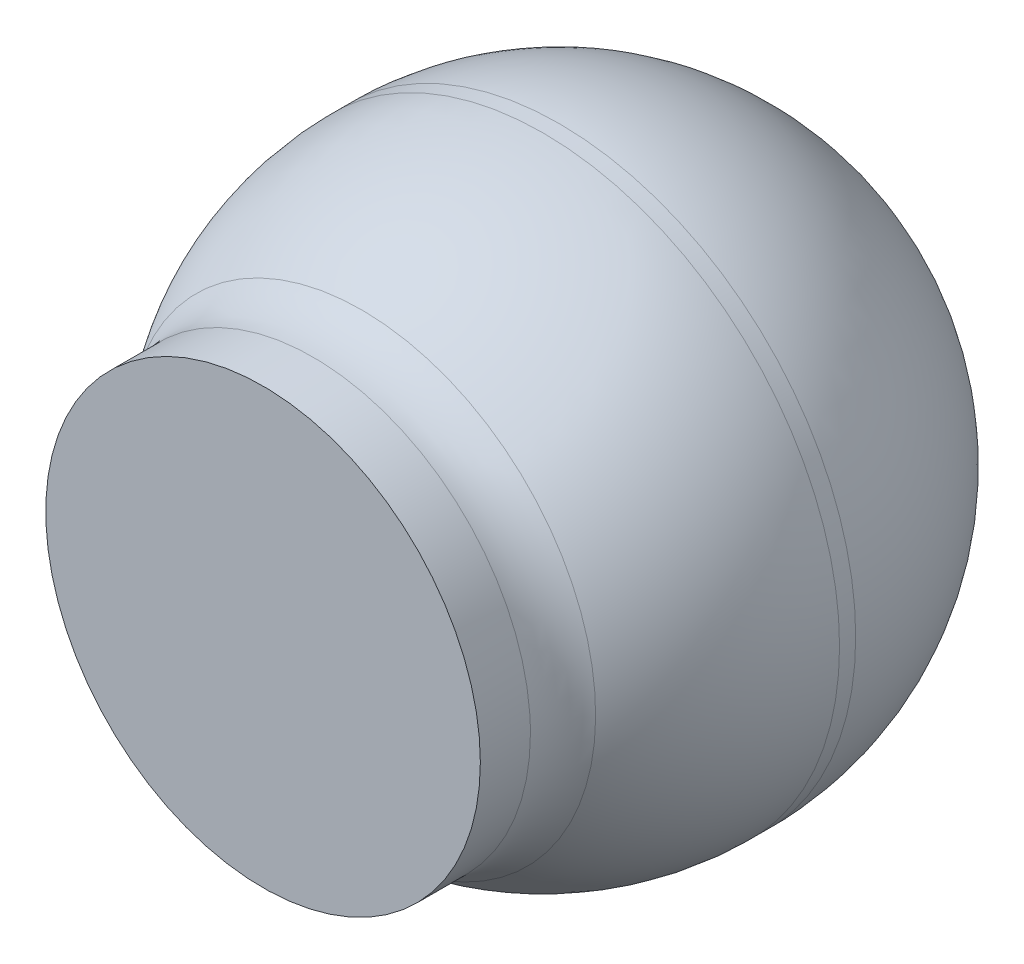
ISO-10303-21;
HEADER;
FILE_DESCRIPTION(('STEP AP214'),'2;1');
FILE_NAME('part.step','',(''),(''),'','','');
FILE_SCHEMA(('AUTOMOTIVE_DESIGN { 1 0 10303 214 1 1 1 1 }'));
ENDSEC;
DATA;
#1=APPLICATION_CONTEXT('core data for automotive mechanical design processes');
#2=APPLICATION_PROTOCOL_DEFINITION('international standard','automotive_design',2000,#1);
#3=PRODUCT_CONTEXT('',#1,'mechanical');
#4=PRODUCT('Part','Part','',(#3));
#5=PRODUCT_RELATED_PRODUCT_CATEGORY('part','',(#4));
#6=PRODUCT_DEFINITION_FORMATION('','',#4);
#7=PRODUCT_DEFINITION_CONTEXT('part definition',#1,'design');
#8=PRODUCT_DEFINITION('design','',#6,#7);
#9=PRODUCT_DEFINITION_SHAPE('','',#8);
#10=(LENGTH_UNIT() NAMED_UNIT(*) SI_UNIT(.MILLI.,.METRE.));
#11=(NAMED_UNIT(*) PLANE_ANGLE_UNIT() SI_UNIT($,.RADIAN.));
#12=(NAMED_UNIT(*) SI_UNIT($,.STERADIAN.) SOLID_ANGLE_UNIT());
#13=UNCERTAINTY_MEASURE_WITH_UNIT(LENGTH_MEASURE(1.E-05),#10,'distance_accuracy_value','');
#14=(GEOMETRIC_REPRESENTATION_CONTEXT(3) GLOBAL_UNCERTAINTY_ASSIGNED_CONTEXT((#13)) GLOBAL_UNIT_ASSIGNED_CONTEXT((#10,
#11,#12)) REPRESENTATION_CONTEXT('',''));
#15=CARTESIAN_POINT('',(0.,0.,0.));
#16=DIRECTION('',(0.,0.,1.));
#17=DIRECTION('',(1.,0.,0.));
#18=AXIS2_PLACEMENT_3D('',#15,#16,#17);
#19=CARTESIAN_POINT('',(-9.452919922269,-0.241349291452,10.006534503384));
#20=DIRECTION('',(0.,0.,-1.));
#21=DIRECTION('',(-1.,0.,0.));
#22=AXIS2_PLACEMENT_3D('',#19,#20,#21);
#23=PLANE('',#22);
#24=CARTESIAN_POINT('',(-9.452919922269,-0.241349291452,10.006534503384));
#25=DIRECTION('',(0.,0.,1.));
#26=DIRECTION('',(1.,0.,0.));
#27=AXIS2_PLACEMENT_3D('',#24,#25,#26);
#28=CIRCLE('',#27,0.275);
#29=CARTESIAN_POINT('',(-9.177919922269,-0.241349291452,10.006534503384));
#30=VERTEX_POINT('',#29);
#31=EDGE_CURVE('E20',#30,#30,#28,.F.);
#32=ORIENTED_EDGE('',*,*,#31,.F.);
#33=EDGE_LOOP('',(#32));
#34=FACE_BOUND('',#33,.T.);
#35=ADVANCED_FACE('F17',(#34),#23,.F.);
#36=CARTESIAN_POINT('',(-9.452919922269,-0.241349291452,9.906534503384));
#37=DIRECTION('',(0.,0.,1.));
#38=DIRECTION('',(1.,0.,0.));
#39=AXIS2_PLACEMENT_3D('',#36,#37,#38);
#40=CYLINDRICAL_SURFACE('',#39,0.275);
#41=CARTESIAN_POINT('',(-9.452919922269,-0.241349291452,9.943180457728));
#42=DIRECTION('',(0.,0.,-1.));
#43=DIRECTION('',(0.996700902337582,0.0811622527992455,0.));
#44=AXIS2_PLACEMENT_3D('',#41,#42,#43);
#45=CIRCLE('',#44,0.275000000000001);
#46=CARTESIAN_POINT('',(-9.17882717412617,-0.219029671932207,9.943180457728));
#47=VERTEX_POINT('',#46);
#48=EDGE_CURVE('E65',#47,#47,#45,.F.);
#49=ORIENTED_EDGE('',*,*,#48,.T.);
#50=EDGE_LOOP('',(#49));
#51=FACE_BOUND('',#50,.T.);
#52=ORIENTED_EDGE('',*,*,#31,.T.);
#53=EDGE_LOOP('',(#52));
#54=FACE_BOUND('',#53,.T.);
#55=ADVANCED_FACE('F62',(#51,#54),#40,.T.);
#56=CARTESIAN_POINT('',(-9.452919922269,-0.241349291452,9.943180457728));
#57=DIRECTION('',(0.,0.,-1.));
#58=DIRECTION('',(0.996700902337583,0.081162252799246,0.));
#59=AXIS2_PLACEMENT_3D('',#56,#57,#58);
#60=TOROIDAL_SURFACE('',#59,0.375,0.1);
#61=ORIENTED_EDGE('',*,*,#48,.F.);
#62=EDGE_LOOP('',(#61));
#63=FACE_BOUND('',#62,.T.);
#64=CARTESIAN_POINT('',(-9.452919922269,-0.241349291452,9.881744931236));
#65=DIRECTION('',(0.,0.,-1.));
#66=DIRECTION('',(-0.996700902337598,-0.0811622527990612,0.));
#67=AXIS2_PLACEMENT_3D('',#64,#65,#66);
#68=CIRCLE('',#67,0.296097046412663);
#69=CARTESIAN_POINT('',(-9.748040115608,-0.265381194786,9.881744931236));
#70=VERTEX_POINT('',#69);
#71=EDGE_CURVE('E39',#70,#70,#68,.T.);
#72=ORIENTED_EDGE('',*,*,#71,.F.);
#73=EDGE_LOOP('',(#72));
#74=FACE_BOUND('',#73,.T.);
#75=ADVANCED_FACE('F57',(#63,#74),#60,.F.);
#76=CARTESIAN_POINT('',(-9.826682760645,-0.271785136252,9.651976062157));
#77=CARTESIAN_POINT('',(-9.826682760645,-0.271785136252,9.701461392103));
#78=CARTESIAN_POINT('',(-9.818526217348,-0.271120941579,9.750947004335));
#79=CARTESIAN_POINT('',(-9.802207085349,-0.269792059952,9.798626332798));
#80=CARTESIAN_POINT('',(-9.778341390838,-0.267848654938,9.842699544317));
#81=CARTESIAN_POINT('',(-9.748040115608,-0.265381194786,9.881744931236));
#82=(BOUNDED_CURVE() B_SPLINE_CURVE(5,(#76,#77,#78,#79,#80,#81),.UNSPECIFIED.,.F.,
.F.) B_SPLINE_CURVE_WITH_KNOTS((6,6),(0.,0.661568582165),
.UNSPECIFIED.) CURVE() GEOMETRIC_REPRESENTATION_ITEM() RATIONAL_B_SPLINE_CURVE((1.,1.,1.,1.,1.,1.)) REPRESENTATION_ITEM(''));
#83=CARTESIAN_POINT('',(-9.452919922269,-0.241349291452,9.651976062157));
#84=DIRECTION('',(0.,0.,-1.));
#85=AXIS1_PLACEMENT('',#83,#84);
#86=SURFACE_OF_REVOLUTION('',#82,#85);
#87=CARTESIAN_POINT('',(-9.452919922269,-0.241349291452,9.651976062157));
#88=DIRECTION('',(0.,0.,1.));
#89=DIRECTION('',(1.,0.,0.));
#90=AXIS2_PLACEMENT_3D('',#87,#88,#89);
#91=CIRCLE('',#90,0.375);
#92=CARTESIAN_POINT('',(-9.077919922269,-0.241349291452,9.651976062157));
#93=VERTEX_POINT('',#92);
#94=EDGE_CURVE('E36',#93,#93,#91,.F.);
#95=ORIENTED_EDGE('',*,*,#94,.F.);
#96=EDGE_LOOP('',(#95));
#97=FACE_BOUND('',#96,.T.);
#98=ORIENTED_EDGE('',*,*,#71,.T.);
#99=EDGE_LOOP('',(#98));
#100=FACE_BOUND('',#99,.T.);
#101=ADVANCED_FACE('F53',(#97,#100),#86,.F.);
#102=CARTESIAN_POINT('',(-9.452919922269,-0.241349291452,9.256534503384));
#103=DIRECTION('',(0.,0.,1.));
#104=DIRECTION('',(1.,0.,0.));
#105=AXIS2_PLACEMENT_3D('',#102,#103,#104);
#106=CYLINDRICAL_SURFACE('',#105,0.375);
#107=CARTESIAN_POINT('',(-9.452919922269,-0.241349291452,9.631534503384));
#108=DIRECTION('',(0.,0.,-1.));
#109=DIRECTION('',(0.0811622527992356,-0.996700902337583,0.));
#110=AXIS2_PLACEMENT_3D('',#107,#108,#109);
#111=CIRCLE('',#110,0.375);
#112=CARTESIAN_POINT('',(-9.42248407746929,-0.615112129828594,9.631534503384));
#113=VERTEX_POINT('',#112);
#114=CARTESIAN_POINT('',(-9.48335576706871,0.132413546924594,9.631534503384));
#115=VERTEX_POINT('',#114);
#116=EDGE_CURVE('E11',#113,#115,#111,.T.);
#117=ORIENTED_EDGE('',*,*,#116,.F.);
#118=CARTESIAN_POINT('',(-9.452919922269,-0.241349291452,9.631534503384));
#119=DIRECTION('',(3.33436315446763E-12,2.72100352061447E-13,1.));
#120=DIRECTION('',(0.0811622527992365,-0.996700902337583,0.));
#121=AXIS2_PLACEMENT_3D('',#118,#119,#120);
#122=CIRCLE('',#121,0.375);
#123=EDGE_CURVE('E25',#115,#113,#122,.F.);
#124=ORIENTED_EDGE('',*,*,#123,.F.);
#125=EDGE_LOOP('',(#117,#124));
#126=FACE_BOUND('',#125,.T.);
#127=ORIENTED_EDGE('',*,*,#94,.T.);
#128=EDGE_LOOP('',(#127));
#129=FACE_BOUND('',#128,.T.);
#130=ADVANCED_FACE('F34',(#126,#129),#106,.T.);
#131=CARTESIAN_POINT('',(-9.452919922269,-0.241349291452,9.631534503384));
#132=DIRECTION('',(0.0811622527992361,-0.996700902337583,0.));
#133=DIRECTION('',(-0.996700902337583,-0.0811622527992361,0.));
#134=AXIS2_PLACEMENT_3D('',#131,#132,#133);
#135=SPHERICAL_SURFACE('',#134,0.375);
#136=ORIENTED_EDGE('',*,*,#123,.T.);
#137=ORIENTED_EDGE('',*,*,#116,.T.);
#138=EDGE_LOOP('',(#136,#137));
#139=FACE_BOUND('',#138,.T.);
#140=ADVANCED_FACE('F32',(#139),#135,.T.);
#141=CLOSED_SHELL('',(#35,#55,#75,#101,#130,#140));
#142=MANIFOLD_SOLID_BREP('B1',#141);
#143=ADVANCED_BREP_SHAPE_REPRESENTATION('',(#18,#142),#14);
#144=SHAPE_DEFINITION_REPRESENTATION(#9,#143);
ENDSEC;
END-ISO-10303-21;
